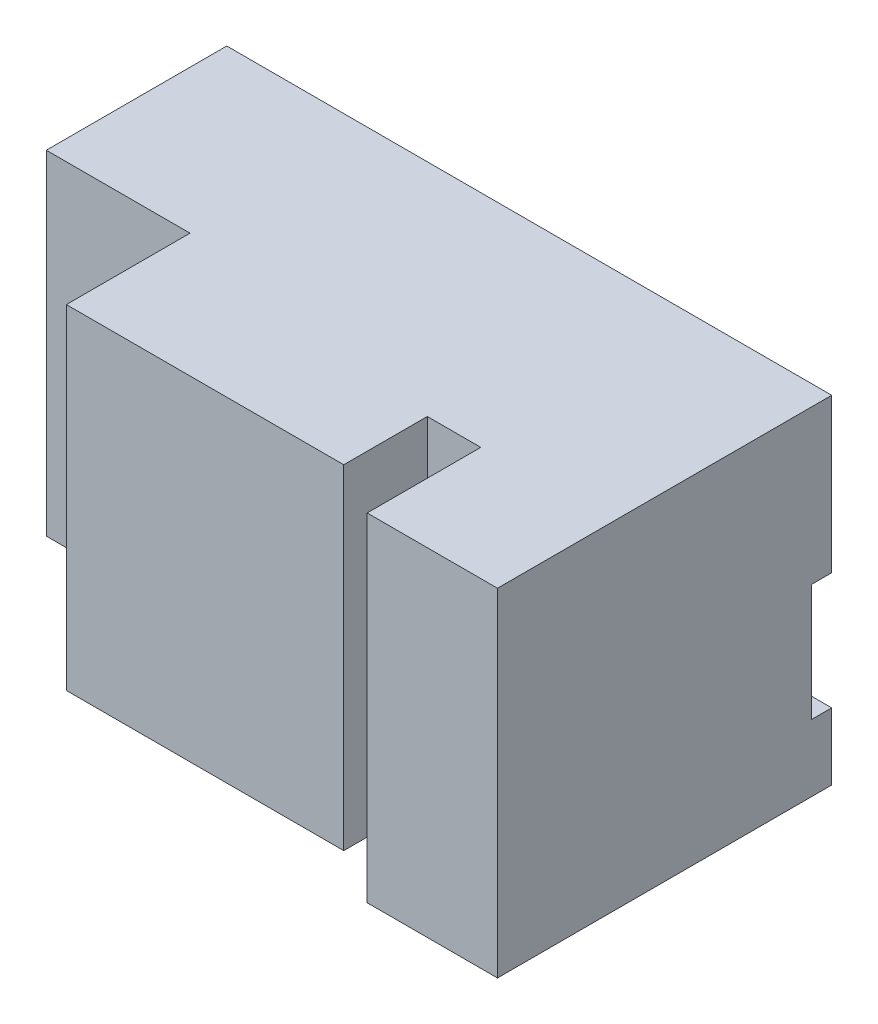
ISO-10303-21;
HEADER;
FILE_DESCRIPTION(('STEP AP214'),'2;1');
FILE_NAME('part.step','',(''),(''),'','','');
FILE_SCHEMA(('AUTOMOTIVE_DESIGN { 1 0 10303 214 1 1 1 1 }'));
ENDSEC;
DATA;
#1=APPLICATION_CONTEXT('core data for automotive mechanical design processes');
#2=APPLICATION_PROTOCOL_DEFINITION('international standard','automotive_design',2000,#1);
#3=PRODUCT_CONTEXT('',#1,'mechanical');
#4=PRODUCT('Part','Part','',(#3));
#5=PRODUCT_RELATED_PRODUCT_CATEGORY('part','',(#4));
#6=PRODUCT_DEFINITION_FORMATION('','',#4);
#7=PRODUCT_DEFINITION_CONTEXT('part definition',#1,'design');
#8=PRODUCT_DEFINITION('design','',#6,#7);
#9=PRODUCT_DEFINITION_SHAPE('','',#8);
#10=(LENGTH_UNIT() NAMED_UNIT(*) SI_UNIT(.MILLI.,.METRE.));
#11=(NAMED_UNIT(*) PLANE_ANGLE_UNIT() SI_UNIT($,.RADIAN.));
#12=(NAMED_UNIT(*) SI_UNIT($,.STERADIAN.) SOLID_ANGLE_UNIT());
#13=UNCERTAINTY_MEASURE_WITH_UNIT(LENGTH_MEASURE(1.E-05),#10,'distance_accuracy_value','');
#14=(GEOMETRIC_REPRESENTATION_CONTEXT(3) GLOBAL_UNCERTAINTY_ASSIGNED_CONTEXT((#13)) GLOBAL_UNIT_ASSIGNED_CONTEXT((#10,
#11,#12)) REPRESENTATION_CONTEXT('',''));
#15=CARTESIAN_POINT('',(0.,0.,0.));
#16=DIRECTION('',(0.,0.,1.));
#17=DIRECTION('',(1.,0.,0.));
#18=AXIS2_PLACEMENT_3D('',#15,#16,#17);
#19=CARTESIAN_POINT('',(-21.5,-50.,54.));
#20=DIRECTION('',(0.,1.,0.));
#21=DIRECTION('',(0.,0.,1.));
#22=AXIS2_PLACEMENT_3D('',#19,#20,#21);
#23=PLANE('',#22);
#24=DIRECTION('',(0.,0.,-1.));
#25=VECTOR('',#24,1.);
#26=CARTESIAN_POINT('',(120.5,-50.,100.));
#27=LINE('',#26,#25);
#28=CARTESIAN_POINT('',(120.5,-50.,66.));
#29=VERTEX_POINT('',#28);
#30=CARTESIAN_POINT('',(120.5,-50.,0.));
#31=VERTEX_POINT('',#30);
#32=EDGE_CURVE('E11',#29,#31,#27,.T.);
#33=ORIENTED_EDGE('',*,*,#32,.F.);
#34=DIRECTION('',(1.,0.,0.));
#35=VECTOR('',#34,1.);
#36=CARTESIAN_POINT('',(104.5,-50.,66.));
#37=LINE('',#36,#35);
#38=CARTESIAN_POINT('',(104.5,-50.,66.));
#39=VERTEX_POINT('',#38);
#40=EDGE_CURVE('E241',#39,#29,#37,.T.);
#41=ORIENTED_EDGE('',*,*,#40,.F.);
#42=DIRECTION('',(0.,0.,-1.));
#43=VECTOR('',#42,1.);
#44=CARTESIAN_POINT('',(104.5,-50.,91.));
#45=LINE('',#44,#43);
#46=CARTESIAN_POINT('',(104.5,-50.,91.));
#47=VERTEX_POINT('',#46);
#48=EDGE_CURVE('E272',#47,#39,#45,.T.);
#49=ORIENTED_EDGE('',*,*,#48,.F.);
#50=DIRECTION('',(1.,0.,0.));
#51=VECTOR('',#50,1.);
#52=CARTESIAN_POINT('',(21.5,-50.,91.));
#53=LINE('',#52,#51);
#54=CARTESIAN_POINT('',(21.5,-50.,91.));
#55=VERTEX_POINT('',#54);
#56=EDGE_CURVE('E257',#55,#47,#53,.T.);
#57=ORIENTED_EDGE('',*,*,#56,.F.);
#58=DIRECTION('',(0.,0.,-1.));
#59=VECTOR('',#58,1.);
#60=CARTESIAN_POINT('',(21.5,-50.,91.));
#61=LINE('',#60,#59);
#62=CARTESIAN_POINT('',(21.5,-50.,54.));
#63=VERTEX_POINT('',#62);
#64=EDGE_CURVE('E275',#55,#63,#61,.T.);
#65=ORIENTED_EDGE('',*,*,#64,.T.);
#66=DIRECTION('',(1.,0.,0.));
#67=VECTOR('',#66,1.);
#68=CARTESIAN_POINT('',(-21.5,-50.,54.));
#69=LINE('',#68,#67);
#70=CARTESIAN_POINT('',(-21.5,-50.,54.));
#71=VERTEX_POINT('',#70);
#72=EDGE_CURVE('E291',#71,#63,#69,.T.);
#73=ORIENTED_EDGE('',*,*,#72,.F.);
#74=DIRECTION('',(0.,0.,-1.));
#75=VECTOR('',#74,1.);
#76=CARTESIAN_POINT('',(-21.5,-50.,54.));
#77=LINE('',#76,#75);
#78=CARTESIAN_POINT('',(-21.5,-50.,0.));
#79=VERTEX_POINT('',#78);
#80=EDGE_CURVE('E295',#71,#79,#77,.T.);
#81=ORIENTED_EDGE('',*,*,#80,.T.);
#82=DIRECTION('',(1.,0.,0.));
#83=VECTOR('',#82,1.);
#84=CARTESIAN_POINT('',(-21.5,-50.,0.));
#85=LINE('',#84,#83);
#86=EDGE_CURVE('E285',#79,#31,#85,.T.);
#87=ORIENTED_EDGE('',*,*,#86,.T.);
#88=EDGE_LOOP('',(#33,#41,#49,#57,#65,#73,#81,#87));
#89=FACE_BOUND('',#88,.T.);
#90=ADVANCED_FACE('F41',(#89),#23,.F.);
#91=CARTESIAN_POINT('',(0.,0.,0.));
#92=DIRECTION('',(0.,0.,-1.));
#93=DIRECTION('',(-1.,0.,0.));
#94=AXIS2_PLACEMENT_3D('',#91,#92,#93);
#95=PLANE('',#94);
#96=DIRECTION('',(1.,0.,0.));
#97=VECTOR('',#96,1.);
#98=CARTESIAN_POINT('',(-40.5,3.99999999999995,0.));
#99=LINE('',#98,#97);
#100=CARTESIAN_POINT('',(-21.5,3.99999999999996,0.));
#101=VERTEX_POINT('',#100);
#102=CARTESIAN_POINT('',(159.5,4.00000000000001,0.));
#103=VERTEX_POINT('',#102);
#104=EDGE_CURVE('E204',#101,#103,#99,.T.);
#105=ORIENTED_EDGE('',*,*,#104,.F.);
#106=DIRECTION('',(0.,-1.,0.));
#107=VECTOR('',#106,1.);
#108=CARTESIAN_POINT('',(-21.5,-50.,0.));
#109=LINE('',#108,#107);
#110=CARTESIAN_POINT('',(-21.5,50.,0.));
#111=VERTEX_POINT('',#110);
#112=EDGE_CURVE('E299',#111,#101,#109,.T.);
#113=ORIENTED_EDGE('',*,*,#112,.F.);
#114=DIRECTION('',(-1.,0.,0.));
#115=VECTOR('',#114,1.);
#116=CARTESIAN_POINT('',(-21.5,50.,0.));
#117=LINE('',#116,#115);
#118=CARTESIAN_POINT('',(159.5,50.,0.));
#119=VERTEX_POINT('',#118);
#120=EDGE_CURVE('E279',#119,#111,#117,.T.);
#121=ORIENTED_EDGE('',*,*,#120,.F.);
#122=DIRECTION('',(0.,1.,0.));
#123=VECTOR('',#122,1.);
#124=CARTESIAN_POINT('',(159.5,50.,0.));
#125=LINE('',#124,#123);
#126=EDGE_CURVE('E223',#103,#119,#125,.T.);
#127=ORIENTED_EDGE('',*,*,#126,.F.);
#128=EDGE_LOOP('',(#105,#113,#121,#127));
#129=FACE_BOUND('',#128,.T.);
#130=ADVANCED_FACE('F322',(#129),#95,.T.);
#131=CARTESIAN_POINT('',(104.5,50.,91.));
#132=DIRECTION('',(-1.,0.,0.));
#133=DIRECTION('',(0.,0.,1.));
#134=AXIS2_PLACEMENT_3D('',#131,#132,#133);
#135=PLANE('',#134);
#136=DIRECTION('',(0.,-1.,0.));
#137=VECTOR('',#136,1.);
#138=CARTESIAN_POINT('',(104.5,50.,66.));
#139=LINE('',#138,#137);
#140=CARTESIAN_POINT('',(104.5,50.,66.));
#141=VERTEX_POINT('',#140);
#142=EDGE_CURVE('E66',#141,#39,#139,.T.);
#143=ORIENTED_EDGE('',*,*,#142,.F.);
#144=DIRECTION('',(0.,0.,-1.));
#145=VECTOR('',#144,1.);
#146=CARTESIAN_POINT('',(104.5,50.,91.));
#147=LINE('',#146,#145);
#148=CARTESIAN_POINT('',(104.5,50.,91.));
#149=VERTEX_POINT('',#148);
#150=EDGE_CURVE('E269',#149,#141,#147,.T.);
#151=ORIENTED_EDGE('',*,*,#150,.F.);
#152=DIRECTION('',(0.,1.,0.));
#153=VECTOR('',#152,1.);
#154=CARTESIAN_POINT('',(104.5,50.,91.));
#155=LINE('',#154,#153);
#156=EDGE_CURVE('E260',#47,#149,#155,.T.);
#157=ORIENTED_EDGE('',*,*,#156,.F.);
#158=ORIENTED_EDGE('',*,*,#48,.T.);
#159=EDGE_LOOP('',(#143,#151,#157,#158));
#160=FACE_BOUND('',#159,.T.);
#161=ADVANCED_FACE('F355',(#160),#135,.F.);
#162=CARTESIAN_POINT('',(-21.5,50.,54.));
#163=DIRECTION('',(0.,-1.,0.));
#164=DIRECTION('',(0.,0.,-1.));
#165=AXIS2_PLACEMENT_3D('',#162,#163,#164);
#166=PLANE('',#165);
#167=ORIENTED_EDGE('',*,*,#120,.T.);
#168=DIRECTION('',(0.,0.,-1.));
#169=VECTOR('',#168,1.);
#170=CARTESIAN_POINT('',(-21.5,50.,54.));
#171=LINE('',#170,#169);
#172=CARTESIAN_POINT('',(-21.5,50.,54.));
#173=VERTEX_POINT('',#172);
#174=EDGE_CURVE('E45',#173,#111,#171,.T.);
#175=ORIENTED_EDGE('',*,*,#174,.F.);
#176=DIRECTION('',(-1.,0.,0.));
#177=VECTOR('',#176,1.);
#178=CARTESIAN_POINT('',(-21.5,50.,54.));
#179=LINE('',#178,#177);
#180=CARTESIAN_POINT('',(21.5,50.,54.));
#181=VERTEX_POINT('',#180);
#182=EDGE_CURVE('E284',#181,#173,#179,.T.);
#183=ORIENTED_EDGE('',*,*,#182,.F.);
#184=DIRECTION('',(0.,0.,-1.));
#185=VECTOR('',#184,1.);
#186=CARTESIAN_POINT('',(21.5,50.,91.));
#187=LINE('',#186,#185);
#188=CARTESIAN_POINT('',(21.5,50.,91.));
#189=VERTEX_POINT('',#188);
#190=EDGE_CURVE('E266',#189,#181,#187,.T.);
#191=ORIENTED_EDGE('',*,*,#190,.F.);
#192=DIRECTION('',(-1.,0.,0.));
#193=VECTOR('',#192,1.);
#194=CARTESIAN_POINT('',(21.5,50.,91.));
#195=LINE('',#194,#193);
#196=EDGE_CURVE('E263',#149,#189,#195,.T.);
#197=ORIENTED_EDGE('',*,*,#196,.F.);
#198=ORIENTED_EDGE('',*,*,#150,.T.);
#199=DIRECTION('',(-1.,0.,0.));
#200=VECTOR('',#199,1.);
#201=CARTESIAN_POINT('',(104.5,50.,66.));
#202=LINE('',#201,#200);
#203=CARTESIAN_POINT('',(120.5,50.,66.));
#204=VERTEX_POINT('',#203);
#205=EDGE_CURVE('E249',#204,#141,#202,.T.);
#206=ORIENTED_EDGE('',*,*,#205,.F.);
#207=DIRECTION('',(0.,0.,-1.));
#208=VECTOR('',#207,1.);
#209=CARTESIAN_POINT('',(120.5,50.,100.));
#210=LINE('',#209,#208);
#211=CARTESIAN_POINT('',(120.5,50.,100.));
#212=VERTEX_POINT('',#211);
#213=EDGE_CURVE('E229',#212,#204,#210,.T.);
#214=ORIENTED_EDGE('',*,*,#213,.F.);
#215=DIRECTION('',(-1.,0.,0.));
#216=VECTOR('',#215,1.);
#217=CARTESIAN_POINT('',(120.5,50.,100.));
#218=LINE('',#217,#216);
#219=CARTESIAN_POINT('',(159.5,50.,100.));
#220=VERTEX_POINT('',#219);
#221=EDGE_CURVE('E158',#220,#212,#218,.T.);
#222=ORIENTED_EDGE('',*,*,#221,.F.);
#223=DIRECTION('',(0.,0.,-1.));
#224=VECTOR('',#223,1.);
#225=CARTESIAN_POINT('',(159.5,50.,100.));
#226=LINE('',#225,#224);
#227=EDGE_CURVE('E235',#220,#119,#226,.T.);
#228=ORIENTED_EDGE('',*,*,#227,.T.);
#229=EDGE_LOOP('',(#167,#175,#183,#191,#197,#198,#206,#214,#222,#228));
#230=FACE_BOUND('',#229,.T.);
#231=ADVANCED_FACE('F43',(#230),#166,.F.);
#232=CARTESIAN_POINT('',(-21.5,-50.,54.));
#233=DIRECTION('',(1.,0.,0.));
#234=DIRECTION('',(0.,0.,-1.));
#235=AXIS2_PLACEMENT_3D('',#232,#233,#234);
#236=PLANE('',#235);
#237=ORIENTED_EDGE('',*,*,#112,.T.);
#238=DIRECTION('',(0.,0.,1.));
#239=VECTOR('',#238,1.);
#240=CARTESIAN_POINT('',(-21.5,3.99999999999996,54.));
#241=LINE('',#240,#239);
#242=CARTESIAN_POINT('',(-21.5,3.99999999999996,6.));
#243=VERTEX_POINT('',#242);
#244=EDGE_CURVE('E216',#101,#243,#241,.T.);
#245=ORIENTED_EDGE('',*,*,#244,.T.);
#246=DIRECTION('',(0.,-1.,0.));
#247=VECTOR('',#246,1.);
#248=CARTESIAN_POINT('',(-21.5,-50.,5.99999999999999));
#249=LINE('',#248,#247);
#250=CARTESIAN_POINT('',(-21.5,-31.,6.));
#251=VERTEX_POINT('',#250);
#252=EDGE_CURVE('E220',#243,#251,#249,.T.);
#253=ORIENTED_EDGE('',*,*,#252,.T.);
#254=DIRECTION('',(0.,0.,-1.));
#255=VECTOR('',#254,1.);
#256=CARTESIAN_POINT('',(-21.5,-31.,54.));
#257=LINE('',#256,#255);
#258=CARTESIAN_POINT('',(-21.5,-31.,0.));
#259=VERTEX_POINT('',#258);
#260=EDGE_CURVE('E203',#251,#259,#257,.T.);
#261=ORIENTED_EDGE('',*,*,#260,.T.);
#262=EDGE_CURVE('E298',#259,#79,#109,.T.);
#263=ORIENTED_EDGE('',*,*,#262,.T.);
#264=ORIENTED_EDGE('',*,*,#80,.F.);
#265=DIRECTION('',(0.,-1.,0.));
#266=VECTOR('',#265,1.);
#267=CARTESIAN_POINT('',(-21.5,-50.,54.));
#268=LINE('',#267,#266);
#269=EDGE_CURVE('E288',#173,#71,#268,.T.);
#270=ORIENTED_EDGE('',*,*,#269,.F.);
#271=ORIENTED_EDGE('',*,*,#174,.T.);
#272=EDGE_LOOP('',(#237,#245,#253,#261,#263,#264,#270,#271));
#273=FACE_BOUND('',#272,.T.);
#274=ADVANCED_FACE('F316',(#273),#236,.F.);
#275=CARTESIAN_POINT('',(0.,0.,54.));
#276=DIRECTION('',(0.,0.,-1.));
#277=DIRECTION('',(-1.,0.,0.));
#278=AXIS2_PLACEMENT_3D('',#275,#276,#277);
#279=PLANE('',#278);
#280=DIRECTION('',(0.,1.,0.));
#281=VECTOR('',#280,1.);
#282=CARTESIAN_POINT('',(21.5,-50.,54.));
#283=LINE('',#282,#281);
#284=EDGE_CURVE('E280',#63,#181,#283,.T.);
#285=ORIENTED_EDGE('',*,*,#284,.T.);
#286=ORIENTED_EDGE('',*,*,#182,.T.);
#287=ORIENTED_EDGE('',*,*,#269,.T.);
#288=ORIENTED_EDGE('',*,*,#72,.T.);
#289=EDGE_LOOP('',(#285,#286,#287,#288));
#290=FACE_BOUND('',#289,.T.);
#291=ADVANCED_FACE('F359',(#290),#279,.F.);
#292=DIRECTION('',(1.,0.,0.));
#293=VECTOR('',#292,1.);
#294=CARTESIAN_POINT('',(-40.5,-31.,0.));
#295=LINE('',#294,#293);
#296=CARTESIAN_POINT('',(159.5,-31.,0.));
#297=VERTEX_POINT('',#296);
#298=EDGE_CURVE('E207',#259,#297,#295,.T.);
#299=ORIENTED_EDGE('',*,*,#298,.T.);
#300=CARTESIAN_POINT('',(159.5,-51.,0.));
#301=VERTEX_POINT('',#300);
#302=EDGE_CURVE('E163',#301,#297,#125,.T.);
#303=ORIENTED_EDGE('',*,*,#302,.F.);
#304=DIRECTION('',(1.,0.,0.));
#305=VECTOR('',#304,1.);
#306=CARTESIAN_POINT('',(159.5,-51.,0.));
#307=LINE('',#306,#305);
#308=CARTESIAN_POINT('',(120.5,-51.,0.));
#309=VERTEX_POINT('',#308);
#310=EDGE_CURVE('E175',#309,#301,#307,.T.);
#311=ORIENTED_EDGE('',*,*,#310,.F.);
#312=DIRECTION('',(0.,1.,0.));
#313=VECTOR('',#312,1.);
#314=CARTESIAN_POINT('',(120.5,-51.,0.));
#315=LINE('',#314,#313);
#316=EDGE_CURVE('E170',#309,#31,#315,.T.);
#317=ORIENTED_EDGE('',*,*,#316,.T.);
#318=ORIENTED_EDGE('',*,*,#86,.F.);
#319=ORIENTED_EDGE('',*,*,#262,.F.);
#320=EDGE_LOOP('',(#299,#303,#311,#317,#318,#319));
#321=FACE_BOUND('',#320,.T.);
#322=ADVANCED_FACE('F336',(#321),#95,.T.);
#323=CARTESIAN_POINT('',(21.5,50.,91.));
#324=DIRECTION('',(1.,0.,0.));
#325=DIRECTION('',(0.,1.,0.));
#326=AXIS2_PLACEMENT_3D('',#323,#324,#325);
#327=PLANE('',#326);
#328=ORIENTED_EDGE('',*,*,#284,.F.);
#329=ORIENTED_EDGE('',*,*,#64,.F.);
#330=DIRECTION('',(0.,-1.,0.));
#331=VECTOR('',#330,1.);
#332=CARTESIAN_POINT('',(21.5,50.,91.));
#333=LINE('',#332,#331);
#334=EDGE_CURVE('E253',#189,#55,#333,.T.);
#335=ORIENTED_EDGE('',*,*,#334,.F.);
#336=ORIENTED_EDGE('',*,*,#190,.T.);
#337=EDGE_LOOP('',(#328,#329,#335,#336));
#338=FACE_BOUND('',#337,.T.);
#339=ADVANCED_FACE('F384',(#338),#327,.F.);
#340=CARTESIAN_POINT('',(0.,0.,91.));
#341=DIRECTION('',(0.,0.,1.));
#342=DIRECTION('',(1.,0.,0.));
#343=AXIS2_PLACEMENT_3D('',#340,#341,#342);
#344=PLANE('',#343);
#345=ORIENTED_EDGE('',*,*,#334,.T.);
#346=ORIENTED_EDGE('',*,*,#56,.T.);
#347=ORIENTED_EDGE('',*,*,#156,.T.);
#348=ORIENTED_EDGE('',*,*,#196,.T.);
#349=EDGE_LOOP('',(#345,#346,#347,#348));
#350=FACE_BOUND('',#349,.T.);
#351=ADVANCED_FACE('F379',(#350),#344,.T.);
#352=CARTESIAN_POINT('',(0.,0.,66.));
#353=DIRECTION('',(0.,0.,1.));
#354=DIRECTION('',(1.,0.,0.));
#355=AXIS2_PLACEMENT_3D('',#352,#353,#354);
#356=PLANE('',#355);
#357=ORIENTED_EDGE('',*,*,#142,.T.);
#358=ORIENTED_EDGE('',*,*,#40,.T.);
#359=DIRECTION('',(0.,1.,0.));
#360=VECTOR('',#359,1.);
#361=CARTESIAN_POINT('',(120.5,50.,66.));
#362=LINE('',#361,#360);
#363=EDGE_CURVE('E245',#29,#204,#362,.T.);
#364=ORIENTED_EDGE('',*,*,#363,.T.);
#365=ORIENTED_EDGE('',*,*,#205,.T.);
#366=EDGE_LOOP('',(#357,#358,#364,#365));
#367=FACE_BOUND('',#366,.T.);
#368=ADVANCED_FACE('F373',(#367),#356,.T.);
#369=CARTESIAN_POINT('',(120.5,50.,100.));
#370=DIRECTION('',(1.,0.,0.));
#371=DIRECTION('',(0.,1.,0.));
#372=AXIS2_PLACEMENT_3D('',#369,#370,#371);
#373=PLANE('',#372);
#374=ORIENTED_EDGE('',*,*,#363,.F.);
#375=ORIENTED_EDGE('',*,*,#32,.T.);
#376=ORIENTED_EDGE('',*,*,#316,.F.);
#377=DIRECTION('',(0.,0.,-1.));
#378=VECTOR('',#377,1.);
#379=CARTESIAN_POINT('',(120.5,-51.,100.));
#380=LINE('',#379,#378);
#381=CARTESIAN_POINT('',(120.5,-51.,100.));
#382=VERTEX_POINT('',#381);
#383=EDGE_CURVE('E166',#382,#309,#380,.T.);
#384=ORIENTED_EDGE('',*,*,#383,.F.);
#385=DIRECTION('',(0.,-1.,0.));
#386=VECTOR('',#385,1.);
#387=CARTESIAN_POINT('',(120.5,50.,100.));
#388=LINE('',#387,#386);
#389=EDGE_CURVE('E152',#212,#382,#388,.T.);
#390=ORIENTED_EDGE('',*,*,#389,.F.);
#391=ORIENTED_EDGE('',*,*,#213,.T.);
#392=EDGE_LOOP('',(#374,#375,#376,#384,#390,#391));
#393=FACE_BOUND('',#392,.T.);
#394=ADVANCED_FACE('F168',(#393),#373,.F.);
#395=CARTESIAN_POINT('',(159.5,50.,100.));
#396=DIRECTION('',(-1.,0.,0.));
#397=DIRECTION('',(0.,-1.,0.));
#398=AXIS2_PLACEMENT_3D('',#395,#396,#397);
#399=PLANE('',#398);
#400=DIRECTION('',(0.,-1.,0.));
#401=VECTOR('',#400,1.);
#402=CARTESIAN_POINT('',(159.5,4.00000000000001,6.));
#403=LINE('',#402,#401);
#404=CARTESIAN_POINT('',(159.5,4.00000000000001,6.));
#405=VERTEX_POINT('',#404);
#406=CARTESIAN_POINT('',(159.5,-31.,5.99999999999999));
#407=VERTEX_POINT('',#406);
#408=EDGE_CURVE('E58',#405,#407,#403,.T.);
#409=ORIENTED_EDGE('',*,*,#408,.F.);
#410=DIRECTION('',(0.,0.,1.));
#411=VECTOR('',#410,1.);
#412=CARTESIAN_POINT('',(159.5,4.00000000000001,6.));
#413=LINE('',#412,#411);
#414=EDGE_CURVE('E195',#103,#405,#413,.T.);
#415=ORIENTED_EDGE('',*,*,#414,.F.);
#416=ORIENTED_EDGE('',*,*,#126,.T.);
#417=ORIENTED_EDGE('',*,*,#227,.F.);
#418=DIRECTION('',(0.,1.,0.));
#419=VECTOR('',#418,1.);
#420=CARTESIAN_POINT('',(159.5,50.,100.));
#421=LINE('',#420,#419);
#422=CARTESIAN_POINT('',(159.5,-51.,100.));
#423=VERTEX_POINT('',#422);
#424=EDGE_CURVE('E162',#423,#220,#421,.T.);
#425=ORIENTED_EDGE('',*,*,#424,.F.);
#426=DIRECTION('',(0.,0.,1.));
#427=VECTOR('',#426,1.);
#428=CARTESIAN_POINT('',(159.5,-51.,0.));
#429=LINE('',#428,#427);
#430=EDGE_CURVE('E180',#301,#423,#429,.T.);
#431=ORIENTED_EDGE('',*,*,#430,.F.);
#432=ORIENTED_EDGE('',*,*,#302,.T.);
#433=DIRECTION('',(0.,0.,-1.));
#434=VECTOR('',#433,1.);
#435=CARTESIAN_POINT('',(159.5,-31.,0.));
#436=LINE('',#435,#434);
#437=EDGE_CURVE('E192',#407,#297,#436,.T.);
#438=ORIENTED_EDGE('',*,*,#437,.F.);
#439=EDGE_LOOP('',(#409,#415,#416,#417,#425,#431,#432,#438));
#440=FACE_BOUND('',#439,.T.);
#441=ADVANCED_FACE('F329',(#440),#399,.F.);
#442=CARTESIAN_POINT('',(0.,0.,100.));
#443=DIRECTION('',(0.,0.,1.));
#444=DIRECTION('',(1.,0.,0.));
#445=AXIS2_PLACEMENT_3D('',#442,#443,#444);
#446=PLANE('',#445);
#447=ORIENTED_EDGE('',*,*,#389,.T.);
#448=DIRECTION('',(-1.,0.,0.));
#449=VECTOR('',#448,1.);
#450=CARTESIAN_POINT('',(159.5,-51.,100.));
#451=LINE('',#450,#449);
#452=EDGE_CURVE('E156',#423,#382,#451,.T.);
#453=ORIENTED_EDGE('',*,*,#452,.F.);
#454=ORIENTED_EDGE('',*,*,#424,.T.);
#455=ORIENTED_EDGE('',*,*,#221,.T.);
#456=EDGE_LOOP('',(#447,#453,#454,#455));
#457=FACE_BOUND('',#456,.T.);
#458=ADVANCED_FACE('F154',(#457),#446,.T.);
#459=CARTESIAN_POINT('',(-40.5,3.99999999999995,6.));
#460=DIRECTION('',(0.,0.,1.));
#461=DIRECTION('',(0.,-1.,0.));
#462=AXIS2_PLACEMENT_3D('',#459,#460,#461);
#463=PLANE('',#462);
#464=DIRECTION('',(1.,0.,0.));
#465=VECTOR('',#464,1.);
#466=CARTESIAN_POINT('',(-40.5,3.99999999999995,6.));
#467=LINE('',#466,#465);
#468=EDGE_CURVE('E200',#243,#405,#467,.T.);
#469=ORIENTED_EDGE('',*,*,#468,.T.);
#470=ORIENTED_EDGE('',*,*,#408,.T.);
#471=DIRECTION('',(1.,0.,0.));
#472=VECTOR('',#471,1.);
#473=CARTESIAN_POINT('',(-40.5,-31.,6.));
#474=LINE('',#473,#472);
#475=EDGE_CURVE('E199',#251,#407,#474,.T.);
#476=ORIENTED_EDGE('',*,*,#475,.F.);
#477=ORIENTED_EDGE('',*,*,#252,.F.);
#478=EDGE_LOOP('',(#469,#470,#476,#477));
#479=FACE_BOUND('',#478,.T.);
#480=ADVANCED_FACE('F339',(#479),#463,.F.);
#481=CARTESIAN_POINT('',(-40.5,3.99999999999995,6.));
#482=DIRECTION('',(0.,1.,0.));
#483=DIRECTION('',(-1.,0.,0.));
#484=AXIS2_PLACEMENT_3D('',#481,#482,#483);
#485=PLANE('',#484);
#486=ORIENTED_EDGE('',*,*,#104,.T.);
#487=ORIENTED_EDGE('',*,*,#414,.T.);
#488=ORIENTED_EDGE('',*,*,#468,.F.);
#489=ORIENTED_EDGE('',*,*,#244,.F.);
#490=EDGE_LOOP('',(#486,#487,#488,#489));
#491=FACE_BOUND('',#490,.T.);
#492=ADVANCED_FACE('F326',(#491),#485,.F.);
#493=CARTESIAN_POINT('',(-40.5,-31.,0.));
#494=DIRECTION('',(0.,-1.,0.));
#495=DIRECTION('',(0.,0.,-1.));
#496=AXIS2_PLACEMENT_3D('',#493,#494,#495);
#497=PLANE('',#496);
#498=ORIENTED_EDGE('',*,*,#475,.T.);
#499=ORIENTED_EDGE('',*,*,#437,.T.);
#500=ORIENTED_EDGE('',*,*,#298,.F.);
#501=ORIENTED_EDGE('',*,*,#260,.F.);
#502=EDGE_LOOP('',(#498,#499,#500,#501));
#503=FACE_BOUND('',#502,.T.);
#504=ADVANCED_FACE('F333',(#503),#497,.F.);
#505=CARTESIAN_POINT('',(0.,-51.,0.));
#506=DIRECTION('',(0.,-1.,0.));
#507=DIRECTION('',(0.,0.,-1.));
#508=AXIS2_PLACEMENT_3D('',#505,#506,#507);
#509=PLANE('',#508);
#510=ORIENTED_EDGE('',*,*,#452,.T.);
#511=ORIENTED_EDGE('',*,*,#383,.T.);
#512=ORIENTED_EDGE('',*,*,#310,.T.);
#513=ORIENTED_EDGE('',*,*,#430,.T.);
#514=EDGE_LOOP('',(#510,#511,#512,#513));
#515=FACE_BOUND('',#514,.T.);
#516=ADVANCED_FACE('F178',(#515),#509,.T.);
#517=CLOSED_SHELL('',(#90,#130,#161,#231,#274,#291,#322,#339,#351,#368,#394,#441,#458,#480,#492,
#504,#516));
#518=MANIFOLD_SOLID_BREP('B2',#517);
#519=ADVANCED_BREP_SHAPE_REPRESENTATION('',(#18,#518),#14);
#520=SHAPE_DEFINITION_REPRESENTATION(#9,#519);
ENDSEC;
END-ISO-10303-21;
